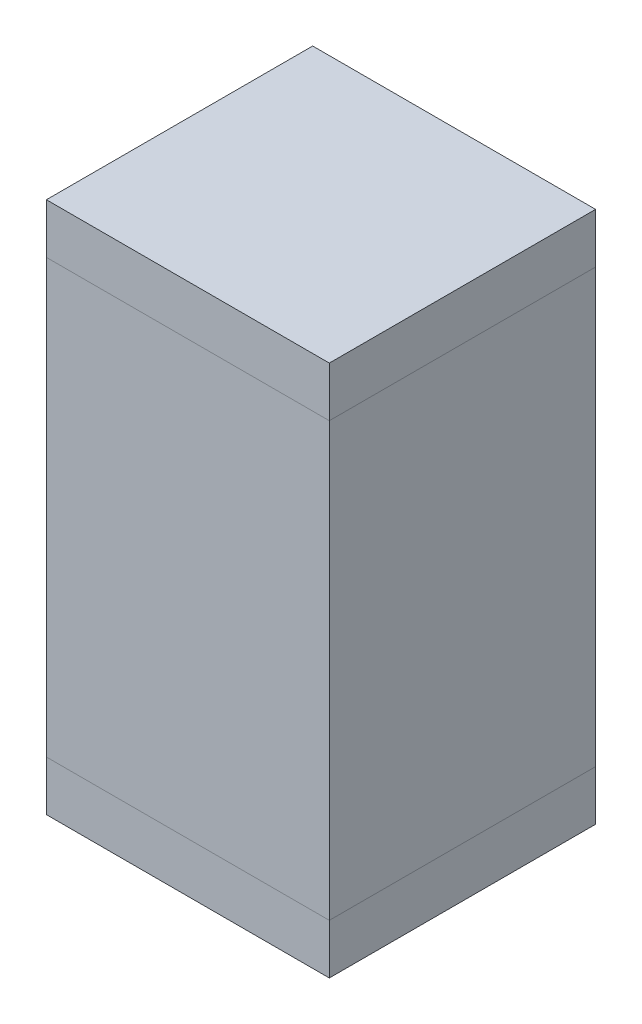
ISO-10303-21;
HEADER;
FILE_DESCRIPTION(('STEP AP214'),'2;1');
FILE_NAME('part.step','',(''),(''),'','','');
FILE_SCHEMA(('AUTOMOTIVE_DESIGN { 1 0 10303 214 1 1 1 1 }'));
ENDSEC;
DATA;
#1=APPLICATION_CONTEXT('core data for automotive mechanical design processes');
#2=APPLICATION_PROTOCOL_DEFINITION('international standard','automotive_design',2000,#1);
#3=PRODUCT_CONTEXT('',#1,'mechanical');
#4=PRODUCT('Part','Part','',(#3));
#5=PRODUCT_RELATED_PRODUCT_CATEGORY('part','',(#4));
#6=PRODUCT_DEFINITION_FORMATION('','',#4);
#7=PRODUCT_DEFINITION_CONTEXT('part definition',#1,'design');
#8=PRODUCT_DEFINITION('design','',#6,#7);
#9=PRODUCT_DEFINITION_SHAPE('','',#8);
#10=(LENGTH_UNIT() NAMED_UNIT(*) SI_UNIT(.MILLI.,.METRE.));
#11=(NAMED_UNIT(*) PLANE_ANGLE_UNIT() SI_UNIT($,.RADIAN.));
#12=(NAMED_UNIT(*) SI_UNIT($,.STERADIAN.) SOLID_ANGLE_UNIT());
#13=UNCERTAINTY_MEASURE_WITH_UNIT(LENGTH_MEASURE(1.E-05),#10,'distance_accuracy_value','');
#14=(GEOMETRIC_REPRESENTATION_CONTEXT(3) GLOBAL_UNCERTAINTY_ASSIGNED_CONTEXT((#13)) GLOBAL_UNIT_ASSIGNED_CONTEXT((#10,
#11,#12)) REPRESENTATION_CONTEXT('',''));
#15=CARTESIAN_POINT('',(0.,0.,0.));
#16=DIRECTION('',(0.,0.,1.));
#17=DIRECTION('',(1.,0.,0.));
#18=AXIS2_PLACEMENT_3D('',#15,#16,#17);
#19=CARTESIAN_POINT('',(0.,0.,0.));
#20=DIRECTION('',(0.,0.,1.));
#21=DIRECTION('',(1.,0.,0.));
#22=AXIS2_PLACEMENT_3D('',#19,#20,#21);
#23=PLANE('',#22);
#24=DIRECTION('',(1.,0.,0.));
#25=VECTOR('',#24,1.);
#26=CARTESIAN_POINT('',(-0.425,0.65,0.));
#27=LINE('',#26,#25);
#28=CARTESIAN_POINT('',(-0.425,0.65,0.));
#29=VERTEX_POINT('',#28);
#30=CARTESIAN_POINT('',(0.425,0.65,0.));
#31=VERTEX_POINT('',#30);
#32=EDGE_CURVE('P0_E26',#29,#31,#27,.T.);
#33=ORIENTED_EDGE('',*,*,#32,.T.);
#34=DIRECTION('',(0.,-1.,0.));
#35=VECTOR('',#34,1.);
#36=CARTESIAN_POINT('',(0.425,0.65,0.));
#37=LINE('',#36,#35);
#38=CARTESIAN_POINT('',(0.425,-0.65,0.));
#39=VERTEX_POINT('',#38);
#40=EDGE_CURVE('P0_E91',#31,#39,#37,.T.);
#41=ORIENTED_EDGE('',*,*,#40,.T.);
#42=DIRECTION('',(-1.,0.,0.));
#43=VECTOR('',#42,1.);
#44=CARTESIAN_POINT('',(0.425,-0.65,0.));
#45=LINE('',#44,#43);
#46=CARTESIAN_POINT('',(-0.425,-0.65,0.));
#47=VERTEX_POINT('',#46);
#48=EDGE_CURVE('P0_E84',#39,#47,#45,.T.);
#49=ORIENTED_EDGE('',*,*,#48,.T.);
#50=DIRECTION('',(0.,1.,0.));
#51=VECTOR('',#50,1.);
#52=CARTESIAN_POINT('',(-0.425,-0.65,0.));
#53=LINE('',#52,#51);
#54=EDGE_CURVE('P0_E69',#47,#29,#53,.T.);
#55=ORIENTED_EDGE('',*,*,#54,.T.);
#56=EDGE_LOOP('',(#33,#41,#49,#55));
#57=FACE_BOUND('',#56,.T.);
#58=ADVANCED_FACE('P0_F17',(#57),#23,.F.);
#59=CARTESIAN_POINT('',(0.,0.,0.8));
#60=DIRECTION('',(0.,0.,1.));
#61=DIRECTION('',(1.,0.,0.));
#62=AXIS2_PLACEMENT_3D('',#59,#60,#61);
#63=PLANE('',#62);
#64=DIRECTION('',(-1.,0.,0.));
#65=VECTOR('',#64,1.);
#66=CARTESIAN_POINT('',(-0.425,0.65,0.8));
#67=LINE('',#66,#65);
#68=CARTESIAN_POINT('',(0.425,0.65,0.8));
#69=VERTEX_POINT('',#68);
#70=CARTESIAN_POINT('',(-0.425,0.65,0.8));
#71=VERTEX_POINT('',#70);
#72=EDGE_CURVE('P0_E11',#69,#71,#67,.T.);
#73=ORIENTED_EDGE('',*,*,#72,.T.);
#74=DIRECTION('',(0.,-1.,0.));
#75=VECTOR('',#74,1.);
#76=CARTESIAN_POINT('',(-0.425,-0.65,0.8));
#77=LINE('',#76,#75);
#78=CARTESIAN_POINT('',(-0.425,-0.65,0.8));
#79=VERTEX_POINT('',#78);
#80=EDGE_CURVE('P0_E79',#71,#79,#77,.T.);
#81=ORIENTED_EDGE('',*,*,#80,.T.);
#82=DIRECTION('',(1.,0.,0.));
#83=VECTOR('',#82,1.);
#84=CARTESIAN_POINT('',(0.425,-0.65,0.8));
#85=LINE('',#84,#83);
#86=CARTESIAN_POINT('',(0.425,-0.65,0.8));
#87=VERTEX_POINT('',#86);
#88=EDGE_CURVE('P0_E86',#79,#87,#85,.T.);
#89=ORIENTED_EDGE('',*,*,#88,.T.);
#90=DIRECTION('',(0.,1.,0.));
#91=VECTOR('',#90,1.);
#92=CARTESIAN_POINT('',(0.425,0.65,0.8));
#93=LINE('',#92,#91);
#94=EDGE_CURVE('P0_E101',#87,#69,#93,.T.);
#95=ORIENTED_EDGE('',*,*,#94,.T.);
#96=EDGE_LOOP('',(#73,#81,#89,#95));
#97=FACE_BOUND('',#96,.T.);
#98=ADVANCED_FACE('P0_F121',(#97),#63,.T.);
#99=CARTESIAN_POINT('',(0.425,0.65,0.));
#100=DIRECTION('',(0.,1.,0.));
#101=DIRECTION('',(1.,0.,0.));
#102=AXIS2_PLACEMENT_3D('',#99,#100,#101);
#103=PLANE('',#102);
#104=ORIENTED_EDGE('',*,*,#32,.F.);
#105=DIRECTION('',(0.,0.,1.));
#106=VECTOR('',#105,1.);
#107=CARTESIAN_POINT('',(-0.425,0.65,0.));
#108=LINE('',#107,#106);
#109=EDGE_CURVE('P0_E75',#29,#71,#108,.T.);
#110=ORIENTED_EDGE('',*,*,#109,.T.);
#111=ORIENTED_EDGE('',*,*,#72,.F.);
#112=DIRECTION('',(0.,0.,1.));
#113=VECTOR('',#112,1.);
#114=CARTESIAN_POINT('',(0.425,0.65,0.));
#115=LINE('',#114,#113);
#116=EDGE_CURVE('P0_E105',#31,#69,#115,.T.);
#117=ORIENTED_EDGE('',*,*,#116,.F.);
#118=EDGE_LOOP('',(#104,#110,#111,#117));
#119=FACE_BOUND('',#118,.T.);
#120=ADVANCED_FACE('P0_F19',(#119),#103,.T.);
#121=CARTESIAN_POINT('',(-0.425,0.65,0.));
#122=DIRECTION('',(-1.,0.,0.));
#123=DIRECTION('',(0.,0.,1.));
#124=AXIS2_PLACEMENT_3D('',#121,#122,#123);
#125=PLANE('',#124);
#126=ORIENTED_EDGE('',*,*,#54,.F.);
#127=DIRECTION('',(0.,0.,1.));
#128=VECTOR('',#127,1.);
#129=CARTESIAN_POINT('',(-0.425,-0.65,0.));
#130=LINE('',#129,#128);
#131=EDGE_CURVE('P0_E73',#47,#79,#130,.T.);
#132=ORIENTED_EDGE('',*,*,#131,.T.);
#133=ORIENTED_EDGE('',*,*,#80,.F.);
#134=ORIENTED_EDGE('',*,*,#109,.F.);
#135=EDGE_LOOP('',(#126,#132,#133,#134));
#136=FACE_BOUND('',#135,.T.);
#137=ADVANCED_FACE('P0_F71',(#136),#125,.T.);
#138=CARTESIAN_POINT('',(-0.425,-0.65,0.));
#139=DIRECTION('',(0.,-1.,0.));
#140=DIRECTION('',(0.,0.,-1.));
#141=AXIS2_PLACEMENT_3D('',#138,#139,#140);
#142=PLANE('',#141);
#143=ORIENTED_EDGE('',*,*,#48,.F.);
#144=DIRECTION('',(0.,0.,1.));
#145=VECTOR('',#144,1.);
#146=CARTESIAN_POINT('',(0.425,-0.65,0.));
#147=LINE('',#146,#145);
#148=EDGE_CURVE('P0_E93',#39,#87,#147,.T.);
#149=ORIENTED_EDGE('',*,*,#148,.T.);
#150=ORIENTED_EDGE('',*,*,#88,.F.);
#151=ORIENTED_EDGE('',*,*,#131,.F.);
#152=EDGE_LOOP('',(#143,#149,#150,#151));
#153=FACE_BOUND('',#152,.T.);
#154=ADVANCED_FACE('P0_F82',(#153),#142,.T.);
#155=CARTESIAN_POINT('',(0.425,-0.65,0.));
#156=DIRECTION('',(1.,0.,0.));
#157=DIRECTION('',(0.,1.,0.));
#158=AXIS2_PLACEMENT_3D('',#155,#156,#157);
#159=PLANE('',#158);
#160=ORIENTED_EDGE('',*,*,#40,.F.);
#161=ORIENTED_EDGE('',*,*,#116,.T.);
#162=ORIENTED_EDGE('',*,*,#94,.F.);
#163=ORIENTED_EDGE('',*,*,#148,.F.);
#164=EDGE_LOOP('',(#160,#161,#162,#163));
#165=FACE_BOUND('',#164,.T.);
#166=ADVANCED_FACE('P0_F117',(#165),#159,.T.);
#167=CLOSED_SHELL('',(#58,#98,#120,#137,#154,#166));
#168=MANIFOLD_SOLID_BREP('P0_B1',#167);
#169=CARTESIAN_POINT('',(0.425,0.65,0.));
#170=DIRECTION('',(0.,1.,0.));
#171=DIRECTION('',(1.,0.,0.));
#172=AXIS2_PLACEMENT_3D('',#169,#170,#171);
#173=PLANE('',#172);
#174=DIRECTION('',(1.,0.,0.));
#175=VECTOR('',#174,1.);
#176=CARTESIAN_POINT('',(-0.425,0.65,0.));
#177=LINE('',#176,#175);
#178=CARTESIAN_POINT('',(-0.425,0.65,0.));
#179=VERTEX_POINT('',#178);
#180=CARTESIAN_POINT('',(0.425,0.65,0.));
#181=VERTEX_POINT('',#180);
#182=EDGE_CURVE('P1_E25',#179,#181,#177,.T.);
#183=ORIENTED_EDGE('',*,*,#182,.T.);
#184=DIRECTION('',(0.,0.,1.));
#185=VECTOR('',#184,1.);
#186=CARTESIAN_POINT('',(0.425,0.65,0.));
#187=LINE('',#186,#185);
#188=CARTESIAN_POINT('',(0.425,0.65,0.8));
#189=VERTEX_POINT('',#188);
#190=EDGE_CURVE('P1_E97',#181,#189,#187,.T.);
#191=ORIENTED_EDGE('',*,*,#190,.T.);
#192=DIRECTION('',(-1.,0.,0.));
#193=VECTOR('',#192,1.);
#194=CARTESIAN_POINT('',(-0.425,0.65,0.8));
#195=LINE('',#194,#193);
#196=CARTESIAN_POINT('',(-0.425,0.65,0.8));
#197=VERTEX_POINT('',#196);
#198=EDGE_CURVE('P1_E79',#189,#197,#195,.T.);
#199=ORIENTED_EDGE('',*,*,#198,.T.);
#200=DIRECTION('',(0.,0.,1.));
#201=VECTOR('',#200,1.);
#202=CARTESIAN_POINT('',(-0.425,0.65,0.));
#203=LINE('',#202,#201);
#204=EDGE_CURVE('P1_E102',#179,#197,#203,.T.);
#205=ORIENTED_EDGE('',*,*,#204,.F.);
#206=EDGE_LOOP('',(#183,#191,#199,#205));
#207=FACE_BOUND('',#206,.T.);
#208=ADVANCED_FACE('P1_F17',(#207),#173,.F.);
#209=CARTESIAN_POINT('',(0.425,0.8,0.));
#210=DIRECTION('',(0.,1.,0.));
#211=DIRECTION('',(1.,0.,0.));
#212=AXIS2_PLACEMENT_3D('',#209,#210,#211);
#213=PLANE('',#212);
#214=DIRECTION('',(-1.,0.,0.));
#215=VECTOR('',#214,1.);
#216=CARTESIAN_POINT('',(-0.425,0.8,0.));
#217=LINE('',#216,#215);
#218=CARTESIAN_POINT('',(0.425,0.8,0.));
#219=VERTEX_POINT('',#218);
#220=CARTESIAN_POINT('',(-0.425,0.8,0.));
#221=VERTEX_POINT('',#220);
#222=EDGE_CURVE('P1_E11',#219,#221,#217,.T.);
#223=ORIENTED_EDGE('',*,*,#222,.T.);
#224=DIRECTION('',(0.,0.,1.));
#225=VECTOR('',#224,1.);
#226=CARTESIAN_POINT('',(-0.425,0.8,0.));
#227=LINE('',#226,#225);
#228=CARTESIAN_POINT('',(-0.425,0.8,0.8));
#229=VERTEX_POINT('',#228);
#230=EDGE_CURVE('P1_E73',#221,#229,#227,.T.);
#231=ORIENTED_EDGE('',*,*,#230,.T.);
#232=DIRECTION('',(1.,0.,0.));
#233=VECTOR('',#232,1.);
#234=CARTESIAN_POINT('',(-0.425,0.8,0.8));
#235=LINE('',#234,#233);
#236=CARTESIAN_POINT('',(0.425,0.8,0.8));
#237=VERTEX_POINT('',#236);
#238=EDGE_CURVE('P1_E66',#229,#237,#235,.T.);
#239=ORIENTED_EDGE('',*,*,#238,.T.);
#240=DIRECTION('',(0.,0.,-1.));
#241=VECTOR('',#240,1.);
#242=CARTESIAN_POINT('',(0.425,0.8,0.));
#243=LINE('',#242,#241);
#244=EDGE_CURVE('P1_E70',#237,#219,#243,.T.);
#245=ORIENTED_EDGE('',*,*,#244,.T.);
#246=EDGE_LOOP('',(#223,#231,#239,#245));
#247=FACE_BOUND('',#246,.T.);
#248=ADVANCED_FACE('P1_F68',(#247),#213,.T.);
#249=CARTESIAN_POINT('',(0.425,0.65,0.));
#250=DIRECTION('',(0.,0.,-1.));
#251=DIRECTION('',(0.,-1.,0.));
#252=AXIS2_PLACEMENT_3D('',#249,#250,#251);
#253=PLANE('',#252);
#254=ORIENTED_EDGE('',*,*,#182,.F.);
#255=DIRECTION('',(0.,1.,0.));
#256=VECTOR('',#255,1.);
#257=CARTESIAN_POINT('',(-0.425,0.65,0.));
#258=LINE('',#257,#256);
#259=EDGE_CURVE('P1_E107',#179,#221,#258,.T.);
#260=ORIENTED_EDGE('',*,*,#259,.T.);
#261=ORIENTED_EDGE('',*,*,#222,.F.);
#262=DIRECTION('',(0.,1.,0.));
#263=VECTOR('',#262,1.);
#264=CARTESIAN_POINT('',(0.425,0.65,0.));
#265=LINE('',#264,#263);
#266=EDGE_CURVE('P1_E91',#181,#219,#265,.T.);
#267=ORIENTED_EDGE('',*,*,#266,.F.);
#268=EDGE_LOOP('',(#254,#260,#261,#267));
#269=FACE_BOUND('',#268,.T.);
#270=ADVANCED_FACE('P1_F115',(#269),#253,.T.);
#271=CARTESIAN_POINT('',(-0.425,0.65,0.));
#272=DIRECTION('',(-1.,0.,0.));
#273=DIRECTION('',(0.,0.,1.));
#274=AXIS2_PLACEMENT_3D('',#271,#272,#273);
#275=PLANE('',#274);
#276=ORIENTED_EDGE('',*,*,#204,.T.);
#277=DIRECTION('',(0.,1.,0.));
#278=VECTOR('',#277,1.);
#279=CARTESIAN_POINT('',(-0.425,0.65,0.8));
#280=LINE('',#279,#278);
#281=EDGE_CURVE('P1_E78',#197,#229,#280,.T.);
#282=ORIENTED_EDGE('',*,*,#281,.T.);
#283=ORIENTED_EDGE('',*,*,#230,.F.);
#284=ORIENTED_EDGE('',*,*,#259,.F.);
#285=EDGE_LOOP('',(#276,#282,#283,#284));
#286=FACE_BOUND('',#285,.T.);
#287=ADVANCED_FACE('P1_F122',(#286),#275,.T.);
#288=CARTESIAN_POINT('',(-0.425,0.65,0.8));
#289=DIRECTION('',(0.,0.,1.));
#290=DIRECTION('',(1.,0.,0.));
#291=AXIS2_PLACEMENT_3D('',#288,#289,#290);
#292=PLANE('',#291);
#293=ORIENTED_EDGE('',*,*,#198,.F.);
#294=DIRECTION('',(0.,1.,0.));
#295=VECTOR('',#294,1.);
#296=CARTESIAN_POINT('',(0.425,0.65,0.8));
#297=LINE('',#296,#295);
#298=EDGE_CURVE('P1_E82',#189,#237,#297,.T.);
#299=ORIENTED_EDGE('',*,*,#298,.T.);
#300=ORIENTED_EDGE('',*,*,#238,.F.);
#301=ORIENTED_EDGE('',*,*,#281,.F.);
#302=EDGE_LOOP('',(#293,#299,#300,#301));
#303=FACE_BOUND('',#302,.T.);
#304=ADVANCED_FACE('P1_F83',(#303),#292,.T.);
#305=CARTESIAN_POINT('',(0.425,0.65,0.8));
#306=DIRECTION('',(1.,0.,0.));
#307=DIRECTION('',(0.,1.,0.));
#308=AXIS2_PLACEMENT_3D('',#305,#306,#307);
#309=PLANE('',#308);
#310=ORIENTED_EDGE('',*,*,#190,.F.);
#311=ORIENTED_EDGE('',*,*,#266,.T.);
#312=ORIENTED_EDGE('',*,*,#244,.F.);
#313=ORIENTED_EDGE('',*,*,#298,.F.);
#314=EDGE_LOOP('',(#310,#311,#312,#313));
#315=FACE_BOUND('',#314,.T.);
#316=ADVANCED_FACE('P1_F90',(#315),#309,.T.);
#317=CLOSED_SHELL('',(#208,#248,#270,#287,#304,#316));
#318=MANIFOLD_SOLID_BREP('P1_B1',#317);
#319=CARTESIAN_POINT('',(-0.425,-0.65,0.));
#320=DIRECTION('',(0.,-1.,0.));
#321=DIRECTION('',(0.,0.,-1.));
#322=AXIS2_PLACEMENT_3D('',#319,#320,#321);
#323=PLANE('',#322);
#324=DIRECTION('',(-1.,0.,0.));
#325=VECTOR('',#324,1.);
#326=CARTESIAN_POINT('',(0.425,-0.65,0.));
#327=LINE('',#326,#325);
#328=CARTESIAN_POINT('',(0.425,-0.65,0.));
#329=VERTEX_POINT('',#328);
#330=CARTESIAN_POINT('',(-0.425,-0.65,0.));
#331=VERTEX_POINT('',#330);
#332=EDGE_CURVE('P2_E26',#329,#331,#327,.T.);
#333=ORIENTED_EDGE('',*,*,#332,.T.);
#334=DIRECTION('',(0.,0.,1.));
#335=VECTOR('',#334,1.);
#336=CARTESIAN_POINT('',(-0.425,-0.65,0.));
#337=LINE('',#336,#335);
#338=CARTESIAN_POINT('',(-0.425,-0.65,0.8));
#339=VERTEX_POINT('',#338);
#340=EDGE_CURVE('P2_E73',#331,#339,#337,.T.);
#341=ORIENTED_EDGE('',*,*,#340,.T.);
#342=DIRECTION('',(1.,0.,0.));
#343=VECTOR('',#342,1.);
#344=CARTESIAN_POINT('',(0.425,-0.65,0.8));
#345=LINE('',#344,#343);
#346=CARTESIAN_POINT('',(0.425,-0.65,0.8));
#347=VERTEX_POINT('',#346);
#348=EDGE_CURVE('P2_E97',#339,#347,#345,.T.);
#349=ORIENTED_EDGE('',*,*,#348,.T.);
#350=DIRECTION('',(0.,0.,1.));
#351=VECTOR('',#350,1.);
#352=CARTESIAN_POINT('',(0.425,-0.65,0.));
#353=LINE('',#352,#351);
#354=EDGE_CURVE('P2_E74',#329,#347,#353,.T.);
#355=ORIENTED_EDGE('',*,*,#354,.F.);
#356=EDGE_LOOP('',(#333,#341,#349,#355));
#357=FACE_BOUND('',#356,.T.);
#358=ADVANCED_FACE('P2_F17',(#357),#323,.F.);
#359=CARTESIAN_POINT('',(-0.425,-0.8,0.));
#360=DIRECTION('',(0.,-1.,0.));
#361=DIRECTION('',(0.,0.,-1.));
#362=AXIS2_PLACEMENT_3D('',#359,#360,#361);
#363=PLANE('',#362);
#364=DIRECTION('',(1.,0.,0.));
#365=VECTOR('',#364,1.);
#366=CARTESIAN_POINT('',(0.425,-0.8,0.));
#367=LINE('',#366,#365);
#368=CARTESIAN_POINT('',(-0.425,-0.8,0.));
#369=VERTEX_POINT('',#368);
#370=CARTESIAN_POINT('',(0.425,-0.8,0.));
#371=VERTEX_POINT('',#370);
#372=EDGE_CURVE('P2_E11',#369,#371,#367,.T.);
#373=ORIENTED_EDGE('',*,*,#372,.T.);
#374=DIRECTION('',(0.,0.,1.));
#375=VECTOR('',#374,1.);
#376=CARTESIAN_POINT('',(0.425,-0.8,0.));
#377=LINE('',#376,#375);
#378=CARTESIAN_POINT('',(0.425,-0.8,0.8));
#379=VERTEX_POINT('',#378);
#380=EDGE_CURVE('P2_E100',#371,#379,#377,.T.);
#381=ORIENTED_EDGE('',*,*,#380,.T.);
#382=DIRECTION('',(-1.,0.,0.));
#383=VECTOR('',#382,1.);
#384=CARTESIAN_POINT('',(0.425,-0.8,0.8));
#385=LINE('',#384,#383);
#386=CARTESIAN_POINT('',(-0.425,-0.8,0.8));
#387=VERTEX_POINT('',#386);
#388=EDGE_CURVE('P2_E103',#379,#387,#385,.T.);
#389=ORIENTED_EDGE('',*,*,#388,.T.);
#390=DIRECTION('',(0.,0.,-1.));
#391=VECTOR('',#390,1.);
#392=CARTESIAN_POINT('',(-0.425,-0.8,0.));
#393=LINE('',#392,#391);
#394=EDGE_CURVE('P2_E83',#387,#369,#393,.T.);
#395=ORIENTED_EDGE('',*,*,#394,.T.);
#396=EDGE_LOOP('',(#373,#381,#389,#395));
#397=FACE_BOUND('',#396,.T.);
#398=ADVANCED_FACE('P2_F119',(#397),#363,.T.);
#399=CARTESIAN_POINT('',(-0.425,-0.65,0.));
#400=DIRECTION('',(0.,0.,-1.));
#401=DIRECTION('',(0.,-1.,0.));
#402=AXIS2_PLACEMENT_3D('',#399,#400,#401);
#403=PLANE('',#402);
#404=ORIENTED_EDGE('',*,*,#332,.F.);
#405=DIRECTION('',(0.,-1.,0.));
#406=VECTOR('',#405,1.);
#407=CARTESIAN_POINT('',(0.425,-0.65,0.));
#408=LINE('',#407,#406);
#409=EDGE_CURVE('P2_E20',#329,#371,#408,.T.);
#410=ORIENTED_EDGE('',*,*,#409,.T.);
#411=ORIENTED_EDGE('',*,*,#372,.F.);
#412=DIRECTION('',(0.,-1.,0.));
#413=VECTOR('',#412,1.);
#414=CARTESIAN_POINT('',(-0.425,-0.65,0.));
#415=LINE('',#414,#413);
#416=EDGE_CURVE('P2_E78',#331,#369,#415,.T.);
#417=ORIENTED_EDGE('',*,*,#416,.F.);
#418=EDGE_LOOP('',(#404,#410,#411,#417));
#419=FACE_BOUND('',#418,.T.);
#420=ADVANCED_FACE('P2_F79',(#419),#403,.T.);
#421=CARTESIAN_POINT('',(0.425,-0.65,0.));
#422=DIRECTION('',(1.,0.,0.));
#423=DIRECTION('',(0.,1.,0.));
#424=AXIS2_PLACEMENT_3D('',#421,#422,#423);
#425=PLANE('',#424);
#426=ORIENTED_EDGE('',*,*,#354,.T.);
#427=DIRECTION('',(0.,-1.,0.));
#428=VECTOR('',#427,1.);
#429=CARTESIAN_POINT('',(0.425,-0.65,0.8));
#430=LINE('',#429,#428);
#431=EDGE_CURVE('P2_E101',#347,#379,#430,.T.);
#432=ORIENTED_EDGE('',*,*,#431,.T.);
#433=ORIENTED_EDGE('',*,*,#380,.F.);
#434=ORIENTED_EDGE('',*,*,#409,.F.);
#435=EDGE_LOOP('',(#426,#432,#433,#434));
#436=FACE_BOUND('',#435,.T.);
#437=ADVANCED_FACE('P2_F116',(#436),#425,.T.);
#438=CARTESIAN_POINT('',(0.425,-0.65,0.8));
#439=DIRECTION('',(0.,0.,1.));
#440=DIRECTION('',(1.,0.,0.));
#441=AXIS2_PLACEMENT_3D('',#438,#439,#440);
#442=PLANE('',#441);
#443=ORIENTED_EDGE('',*,*,#348,.F.);
#444=DIRECTION('',(0.,-1.,0.));
#445=VECTOR('',#444,1.);
#446=CARTESIAN_POINT('',(-0.425,-0.65,0.8));
#447=LINE('',#446,#445);
#448=EDGE_CURVE('P2_E88',#339,#387,#447,.T.);
#449=ORIENTED_EDGE('',*,*,#448,.T.);
#450=ORIENTED_EDGE('',*,*,#388,.F.);
#451=ORIENTED_EDGE('',*,*,#431,.F.);
#452=EDGE_LOOP('',(#443,#449,#450,#451));
#453=FACE_BOUND('',#452,.T.);
#454=ADVANCED_FACE('P2_F118',(#453),#442,.T.);
#455=CARTESIAN_POINT('',(-0.425,-0.65,0.8));
#456=DIRECTION('',(-1.,0.,0.));
#457=DIRECTION('',(0.,0.,1.));
#458=AXIS2_PLACEMENT_3D('',#455,#456,#457);
#459=PLANE('',#458);
#460=ORIENTED_EDGE('',*,*,#340,.F.);
#461=ORIENTED_EDGE('',*,*,#416,.T.);
#462=ORIENTED_EDGE('',*,*,#394,.F.);
#463=ORIENTED_EDGE('',*,*,#448,.F.);
#464=EDGE_LOOP('',(#460,#461,#462,#463));
#465=FACE_BOUND('',#464,.T.);
#466=ADVANCED_FACE('P2_F86',(#465),#459,.T.);
#467=CLOSED_SHELL('',(#358,#398,#420,#437,#454,#466));
#468=MANIFOLD_SOLID_BREP('P2_B1',#467);
#469=ADVANCED_BREP_SHAPE_REPRESENTATION('',(#18,#168,#318,#468),#14);
#470=SHAPE_DEFINITION_REPRESENTATION(#9,#469);
ENDSEC;
END-ISO-10303-21;
